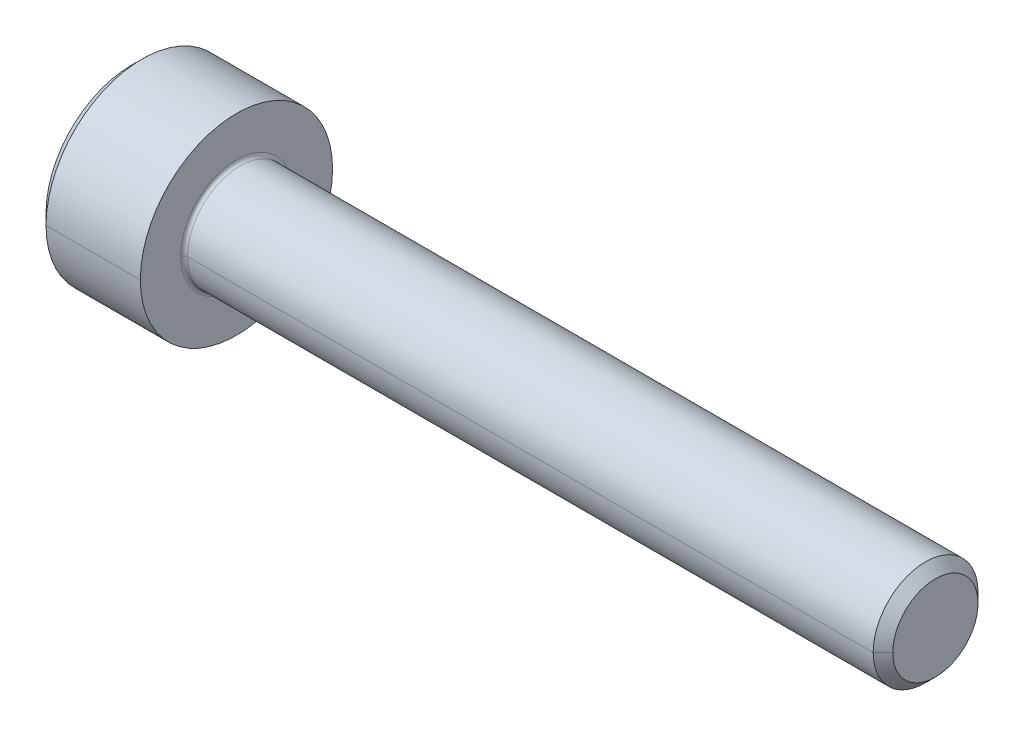
ISO-10303-21;
HEADER;
FILE_DESCRIPTION(('STEP AP214'),'2;1');
FILE_NAME('part.step','',(''),(''),'','','');
FILE_SCHEMA(('AUTOMOTIVE_DESIGN { 1 0 10303 214 1 1 1 1 }'));
ENDSEC;
DATA;
#1=APPLICATION_CONTEXT('core data for automotive mechanical design processes');
#2=APPLICATION_PROTOCOL_DEFINITION('international standard','automotive_design',2000,#1);
#3=PRODUCT_CONTEXT('',#1,'mechanical');
#4=PRODUCT('Part','Part','',(#3));
#5=PRODUCT_RELATED_PRODUCT_CATEGORY('part','',(#4));
#6=PRODUCT_DEFINITION_FORMATION('','',#4);
#7=PRODUCT_DEFINITION_CONTEXT('part definition',#1,'design');
#8=PRODUCT_DEFINITION('design','',#6,#7);
#9=PRODUCT_DEFINITION_SHAPE('','',#8);
#10=(LENGTH_UNIT() NAMED_UNIT(*) SI_UNIT(.MILLI.,.METRE.));
#11=(NAMED_UNIT(*) PLANE_ANGLE_UNIT() SI_UNIT($,.RADIAN.));
#12=(NAMED_UNIT(*) SI_UNIT($,.STERADIAN.) SOLID_ANGLE_UNIT());
#13=UNCERTAINTY_MEASURE_WITH_UNIT(LENGTH_MEASURE(1.E-05),#10,'distance_accuracy_value','');
#14=(GEOMETRIC_REPRESENTATION_CONTEXT(3) GLOBAL_UNCERTAINTY_ASSIGNED_CONTEXT((#13)) GLOBAL_UNIT_ASSIGNED_CONTEXT((#10,
#11,#12)) REPRESENTATION_CONTEXT('',''));
#15=CARTESIAN_POINT('',(0.,0.,0.));
#16=DIRECTION('',(0.,0.,1.));
#17=DIRECTION('',(1.,0.,0.));
#18=AXIS2_PLACEMENT_3D('',#15,#16,#17);
#19=CARTESIAN_POINT('',(1.3,0.,0.));
#20=DIRECTION('',(-1.,0.,0.));
#21=DIRECTION('',(0.,0.,1.));
#22=AXIS2_PLACEMENT_3D('',#19,#20,#21);
#23=CONICAL_SURFACE('',#22,1.28,1.0471975511966);
#24=DIRECTION('',(-0.5,0.,-0.866025403784438));
#25=VECTOR('',#24,1.);
#26=CARTESIAN_POINT('',(1.3,0.,-1.28));
#27=LINE('',#26,#25);
#28=CARTESIAN_POINT('',(2.03900834456273,0.,0.));
#29=VERTEX_POINT('',#28);
#30=CARTESIAN_POINT('',(1.3,0.,-1.28));
#31=VERTEX_POINT('',#30);
#32=EDGE_CURVE('E819',#29,#31,#27,.T.);
#33=ORIENTED_EDGE('',*,*,#32,.F.);
#34=DIRECTION('',(-0.5,0.,0.866025403784438));
#35=VECTOR('',#34,1.);
#36=CARTESIAN_POINT('',(1.3,0.,1.28));
#37=LINE('',#36,#35);
#38=CARTESIAN_POINT('',(1.3,0.,1.28));
#39=VERTEX_POINT('',#38);
#40=EDGE_CURVE('E821',#29,#39,#37,.T.);
#41=ORIENTED_EDGE('',*,*,#40,.T.);
#42=CARTESIAN_POINT('',(1.3,0.,0.));
#43=DIRECTION('',(-1.,0.,0.));
#44=DIRECTION('',(0.,0.,1.));
#45=AXIS2_PLACEMENT_3D('',#42,#43,#44);
#46=CIRCLE('',#45,1.28);
#47=CARTESIAN_POINT('',(1.3,1.10851251684408,0.64));
#48=VERTEX_POINT('',#47);
#49=EDGE_CURVE('E11',#39,#48,#46,.T.);
#50=ORIENTED_EDGE('',*,*,#49,.T.);
#51=CARTESIAN_POINT('',(1.3,0.,0.));
#52=DIRECTION('',(-1.,0.,0.));
#53=DIRECTION('',(0.,0.,1.));
#54=AXIS2_PLACEMENT_3D('',#51,#52,#53);
#55=CIRCLE('',#54,1.28);
#56=CARTESIAN_POINT('',(1.3,1.10851251684408,-0.64));
#57=VERTEX_POINT('',#56);
#58=EDGE_CURVE('E25',#48,#57,#55,.T.);
#59=ORIENTED_EDGE('',*,*,#58,.T.);
#60=CARTESIAN_POINT('',(1.3,0.,0.));
#61=DIRECTION('',(-1.,0.,0.));
#62=DIRECTION('',(0.,0.,1.));
#63=AXIS2_PLACEMENT_3D('',#60,#61,#62);
#64=CIRCLE('',#63,1.28);
#65=EDGE_CURVE('E247',#57,#31,#64,.T.);
#66=ORIENTED_EDGE('',*,*,#65,.T.);
#67=EDGE_LOOP('',(#33,#41,#50,#59,#66));
#68=FACE_BOUND('',#67,.T.);
#69=ADVANCED_FACE('F16',(#68),#23,.F.);
#70=CARTESIAN_POINT('',(1.3,0.73900834456272,1.28));
#71=DIRECTION('',(-1.,0.,0.));
#72=DIRECTION('',(0.,0.,1.));
#73=AXIS2_PLACEMENT_3D('',#70,#71,#72);
#74=PLANE('',#73);
#75=ORIENTED_EDGE('',*,*,#49,.F.);
#76=DIRECTION('',(0.,1.,0.));
#77=VECTOR('',#76,1.);
#78=CARTESIAN_POINT('',(1.3,-0.739008344562722,1.28));
#79=LINE('',#78,#77);
#80=CARTESIAN_POINT('',(1.3,0.73900834456272,1.28));
#81=VERTEX_POINT('',#80);
#82=EDGE_CURVE('E222',#39,#81,#79,.T.);
#83=ORIENTED_EDGE('',*,*,#82,.T.);
#84=DIRECTION('',(0.,-0.5,0.86602540378444));
#85=VECTOR('',#84,1.);
#86=CARTESIAN_POINT('',(1.3,1.47801668912544,0.));
#87=LINE('',#86,#85);
#88=EDGE_CURVE('E215',#48,#81,#87,.T.);
#89=ORIENTED_EDGE('',*,*,#88,.F.);
#90=EDGE_LOOP('',(#75,#83,#89));
#91=FACE_BOUND('',#90,.T.);
#92=ADVANCED_FACE('F520',(#91),#74,.T.);
#93=CARTESIAN_POINT('',(1.3,0.73900834456272,1.28));
#94=DIRECTION('',(-1.,0.,0.));
#95=DIRECTION('',(0.,0.,1.));
#96=AXIS2_PLACEMENT_3D('',#93,#94,#95);
#97=PLANE('',#96);
#98=ORIENTED_EDGE('',*,*,#58,.F.);
#99=DIRECTION('',(0.,-0.5,0.86602540378444));
#100=VECTOR('',#99,1.);
#101=CARTESIAN_POINT('',(1.3,1.47801668912544,0.));
#102=LINE('',#101,#100);
#103=CARTESIAN_POINT('',(1.3,1.47801668912544,0.));
#104=VERTEX_POINT('',#103);
#105=EDGE_CURVE('E214',#104,#48,#102,.T.);
#106=ORIENTED_EDGE('',*,*,#105,.F.);
#107=DIRECTION('',(0.,-0.5,-0.866025403784438));
#108=VECTOR('',#107,1.);
#109=CARTESIAN_POINT('',(1.3,1.47801668912544,0.));
#110=LINE('',#109,#108);
#111=EDGE_CURVE('E199',#104,#57,#110,.T.);
#112=ORIENTED_EDGE('',*,*,#111,.T.);
#113=EDGE_LOOP('',(#98,#106,#112));
#114=FACE_BOUND('',#113,.T.);
#115=ADVANCED_FACE('F511',(#114),#97,.T.);
#116=CARTESIAN_POINT('',(1.3,0.73900834456272,1.28));
#117=DIRECTION('',(-1.,0.,0.));
#118=DIRECTION('',(0.,0.,1.));
#119=AXIS2_PLACEMENT_3D('',#116,#117,#118);
#120=PLANE('',#119);
#121=ORIENTED_EDGE('',*,*,#65,.F.);
#122=DIRECTION('',(0.,-0.5,-0.866025403784438));
#123=VECTOR('',#122,1.);
#124=CARTESIAN_POINT('',(1.3,1.47801668912544,0.));
#125=LINE('',#124,#123);
#126=CARTESIAN_POINT('',(1.3,0.739008344562716,-1.28));
#127=VERTEX_POINT('',#126);
#128=EDGE_CURVE('E196',#57,#127,#125,.T.);
#129=ORIENTED_EDGE('',*,*,#128,.T.);
#130=DIRECTION('',(0.,-1.,0.));
#131=VECTOR('',#130,1.);
#132=CARTESIAN_POINT('',(1.3,0.739008344562716,-1.28));
#133=LINE('',#132,#131);
#134=EDGE_CURVE('E136',#127,#31,#133,.T.);
#135=ORIENTED_EDGE('',*,*,#134,.T.);
#136=EDGE_LOOP('',(#121,#129,#135));
#137=FACE_BOUND('',#136,.T.);
#138=ADVANCED_FACE('F503',(#137),#120,.T.);
#139=CARTESIAN_POINT('',(1.3,0.73900834456272,1.28));
#140=DIRECTION('',(-1.,0.,0.));
#141=DIRECTION('',(0.,0.,1.));
#142=AXIS2_PLACEMENT_3D('',#139,#140,#141);
#143=PLANE('',#142);
#144=CARTESIAN_POINT('',(1.3,0.,0.));
#145=DIRECTION('',(-1.,0.,0.));
#146=DIRECTION('',(0.,0.,1.));
#147=AXIS2_PLACEMENT_3D('',#144,#145,#146);
#148=CIRCLE('',#147,1.28);
#149=CARTESIAN_POINT('',(1.3,-1.10851251684409,-0.64));
#150=VERTEX_POINT('',#149);
#151=EDGE_CURVE('E131',#31,#150,#148,.T.);
#152=ORIENTED_EDGE('',*,*,#151,.F.);
#153=DIRECTION('',(0.,-1.,0.));
#154=VECTOR('',#153,1.);
#155=CARTESIAN_POINT('',(1.3,0.739008344562716,-1.28));
#156=LINE('',#155,#154);
#157=CARTESIAN_POINT('',(1.3,-0.739008344562726,-1.28));
#158=VERTEX_POINT('',#157);
#159=EDGE_CURVE('E122',#31,#158,#156,.T.);
#160=ORIENTED_EDGE('',*,*,#159,.T.);
#161=DIRECTION('',(0.,0.5,-0.86602540378444));
#162=VECTOR('',#161,1.);
#163=CARTESIAN_POINT('',(1.3,-1.47801668912544,0.));
#164=LINE('',#163,#162);
#165=EDGE_CURVE('E127',#150,#158,#164,.T.);
#166=ORIENTED_EDGE('',*,*,#165,.F.);
#167=EDGE_LOOP('',(#152,#160,#166));
#168=FACE_BOUND('',#167,.T.);
#169=ADVANCED_FACE('F124',(#168),#143,.T.);
#170=CARTESIAN_POINT('',(1.3,0.73900834456272,1.28));
#171=DIRECTION('',(-1.,0.,0.));
#172=DIRECTION('',(0.,0.,1.));
#173=AXIS2_PLACEMENT_3D('',#170,#171,#172);
#174=PLANE('',#173);
#175=CARTESIAN_POINT('',(1.3,0.,0.));
#176=DIRECTION('',(-1.,0.,0.));
#177=DIRECTION('',(0.,0.,1.));
#178=AXIS2_PLACEMENT_3D('',#175,#176,#177);
#179=CIRCLE('',#178,1.28);
#180=CARTESIAN_POINT('',(1.3,-1.10851251684408,0.64));
#181=VERTEX_POINT('',#180);
#182=EDGE_CURVE('E834',#150,#181,#179,.T.);
#183=ORIENTED_EDGE('',*,*,#182,.F.);
#184=DIRECTION('',(0.,0.5,-0.86602540378444));
#185=VECTOR('',#184,1.);
#186=CARTESIAN_POINT('',(1.3,-1.47801668912544,0.));
#187=LINE('',#186,#185);
#188=CARTESIAN_POINT('',(1.3,-1.47801668912544,0.));
#189=VERTEX_POINT('',#188);
#190=EDGE_CURVE('E150',#189,#150,#187,.T.);
#191=ORIENTED_EDGE('',*,*,#190,.F.);
#192=DIRECTION('',(0.,-0.5,-0.866025403784438));
#193=VECTOR('',#192,1.);
#194=CARTESIAN_POINT('',(1.3,-0.739008344562722,1.28));
#195=LINE('',#194,#193);
#196=EDGE_CURVE('E236',#181,#189,#195,.T.);
#197=ORIENTED_EDGE('',*,*,#196,.F.);
#198=EDGE_LOOP('',(#183,#191,#197));
#199=FACE_BOUND('',#198,.T.);
#200=ADVANCED_FACE('F486',(#199),#174,.T.);
#201=CARTESIAN_POINT('',(1.3,0.73900834456272,1.28));
#202=DIRECTION('',(-1.,0.,0.));
#203=DIRECTION('',(0.,0.,1.));
#204=AXIS2_PLACEMENT_3D('',#201,#202,#203);
#205=PLANE('',#204);
#206=CARTESIAN_POINT('',(1.3,0.,0.));
#207=DIRECTION('',(-1.,0.,0.));
#208=DIRECTION('',(0.,0.,1.));
#209=AXIS2_PLACEMENT_3D('',#206,#207,#208);
#210=CIRCLE('',#209,1.28);
#211=EDGE_CURVE('E826',#181,#39,#210,.T.);
#212=ORIENTED_EDGE('',*,*,#211,.F.);
#213=DIRECTION('',(0.,-0.5,-0.866025403784438));
#214=VECTOR('',#213,1.);
#215=CARTESIAN_POINT('',(1.3,-0.739008344562722,1.28));
#216=LINE('',#215,#214);
#217=CARTESIAN_POINT('',(1.3,-0.739008344562722,1.28));
#218=VERTEX_POINT('',#217);
#219=EDGE_CURVE('E232',#218,#181,#216,.T.);
#220=ORIENTED_EDGE('',*,*,#219,.F.);
#221=DIRECTION('',(0.,1.,0.));
#222=VECTOR('',#221,1.);
#223=CARTESIAN_POINT('',(1.3,-0.739008344562722,1.28));
#224=LINE('',#223,#222);
#225=EDGE_CURVE('E225',#218,#39,#224,.T.);
#226=ORIENTED_EDGE('',*,*,#225,.T.);
#227=EDGE_LOOP('',(#212,#220,#226));
#228=FACE_BOUND('',#227,.T.);
#229=ADVANCED_FACE('F477',(#228),#205,.T.);
#230=CARTESIAN_POINT('',(1.3,1.47801668912544,0.));
#231=DIRECTION('',(0.,0.866025403784438,-0.5));
#232=DIRECTION('',(-1.,0.,0.));
#233=AXIS2_PLACEMENT_3D('',#230,#231,#232);
#234=PLANE('',#233);
#235=DIRECTION('',(0.,-0.5,-0.866025403784438));
#236=VECTOR('',#235,1.);
#237=CARTESIAN_POINT('',(0.,1.47801668912544,0.));
#238=LINE('',#237,#236);
#239=CARTESIAN_POINT('',(0.,1.47801668912544,0.));
#240=VERTEX_POINT('',#239);
#241=CARTESIAN_POINT('',(0.,0.739008344562716,-1.28));
#242=VERTEX_POINT('',#241);
#243=EDGE_CURVE('E185',#240,#242,#238,.T.);
#244=ORIENTED_EDGE('',*,*,#243,.T.);
#245=DIRECTION('',(-1.,0.,0.));
#246=VECTOR('',#245,1.);
#247=CARTESIAN_POINT('',(1.3,0.739008344562716,-1.28));
#248=LINE('',#247,#246);
#249=EDGE_CURVE('E200',#127,#242,#248,.T.);
#250=ORIENTED_EDGE('',*,*,#249,.F.);
#251=ORIENTED_EDGE('',*,*,#128,.F.);
#252=ORIENTED_EDGE('',*,*,#111,.F.);
#253=DIRECTION('',(-1.,0.,0.));
#254=VECTOR('',#253,1.);
#255=CARTESIAN_POINT('',(1.3,1.47801668912544,0.));
#256=LINE('',#255,#254);
#257=EDGE_CURVE('E211',#104,#240,#256,.T.);
#258=ORIENTED_EDGE('',*,*,#257,.T.);
#259=EDGE_LOOP('',(#244,#250,#251,#252,#258));
#260=FACE_BOUND('',#259,.T.);
#261=ADVANCED_FACE('F469',(#260),#234,.F.);
#262=CARTESIAN_POINT('',(1.3,0.739008344562716,-1.28));
#263=DIRECTION('',(0.,0.,-1.));
#264=DIRECTION('',(0.,-1.,0.));
#265=AXIS2_PLACEMENT_3D('',#262,#263,#264);
#266=PLANE('',#265);
#267=DIRECTION('',(0.,-1.,0.));
#268=VECTOR('',#267,1.);
#269=CARTESIAN_POINT('',(0.,0.739008344562716,-1.28));
#270=LINE('',#269,#268);
#271=CARTESIAN_POINT('',(0.,-0.739008344562726,-1.28));
#272=VERTEX_POINT('',#271);
#273=EDGE_CURVE('E142',#242,#272,#270,.T.);
#274=ORIENTED_EDGE('',*,*,#273,.T.);
#275=DIRECTION('',(-1.,0.,0.));
#276=VECTOR('',#275,1.);
#277=CARTESIAN_POINT('',(1.3,-0.739008344562726,-1.28));
#278=LINE('',#277,#276);
#279=EDGE_CURVE('E137',#158,#272,#278,.T.);
#280=ORIENTED_EDGE('',*,*,#279,.F.);
#281=ORIENTED_EDGE('',*,*,#159,.F.);
#282=ORIENTED_EDGE('',*,*,#134,.F.);
#283=ORIENTED_EDGE('',*,*,#249,.T.);
#284=EDGE_LOOP('',(#274,#280,#281,#282,#283));
#285=FACE_BOUND('',#284,.T.);
#286=ADVANCED_FACE('F140',(#285),#266,.F.);
#287=CARTESIAN_POINT('',(1.3,-1.47801668912544,0.));
#288=DIRECTION('',(0.,0.86602540378444,0.5));
#289=DIRECTION('',(1.,0.,0.));
#290=AXIS2_PLACEMENT_3D('',#287,#288,#289);
#291=PLANE('',#290);
#292=DIRECTION('',(0.,0.5,-0.86602540378444));
#293=VECTOR('',#292,1.);
#294=CARTESIAN_POINT('',(0.,-1.47801668912544,0.));
#295=LINE('',#294,#293);
#296=CARTESIAN_POINT('',(0.,-1.47801668912544,0.));
#297=VERTEX_POINT('',#296);
#298=EDGE_CURVE('E179',#297,#272,#295,.T.);
#299=ORIENTED_EDGE('',*,*,#298,.F.);
#300=DIRECTION('',(-1.,0.,0.));
#301=VECTOR('',#300,1.);
#302=CARTESIAN_POINT('',(1.3,-1.47801668912544,0.));
#303=LINE('',#302,#301);
#304=EDGE_CURVE('E158',#189,#297,#303,.T.);
#305=ORIENTED_EDGE('',*,*,#304,.F.);
#306=ORIENTED_EDGE('',*,*,#190,.T.);
#307=ORIENTED_EDGE('',*,*,#165,.T.);
#308=ORIENTED_EDGE('',*,*,#279,.T.);
#309=EDGE_LOOP('',(#299,#305,#306,#307,#308));
#310=FACE_BOUND('',#309,.T.);
#311=ADVANCED_FACE('F148',(#310),#291,.T.);
#312=CARTESIAN_POINT('',(1.3,-0.739008344562722,1.28));
#313=DIRECTION('',(0.,0.866025403784438,-0.5));
#314=DIRECTION('',(-1.,0.,0.));
#315=AXIS2_PLACEMENT_3D('',#312,#313,#314);
#316=PLANE('',#315);
#317=DIRECTION('',(0.,-0.5,-0.866025403784438));
#318=VECTOR('',#317,1.);
#319=CARTESIAN_POINT('',(0.,-0.739008344562722,1.28));
#320=LINE('',#319,#318);
#321=CARTESIAN_POINT('',(0.,-0.739008344562722,1.28));
#322=VERTEX_POINT('',#321);
#323=EDGE_CURVE('E175',#322,#297,#320,.T.);
#324=ORIENTED_EDGE('',*,*,#323,.F.);
#325=DIRECTION('',(-1.,0.,0.));
#326=VECTOR('',#325,1.);
#327=CARTESIAN_POINT('',(1.3,-0.739008344562722,1.28));
#328=LINE('',#327,#326);
#329=EDGE_CURVE('E229',#218,#322,#328,.T.);
#330=ORIENTED_EDGE('',*,*,#329,.F.);
#331=ORIENTED_EDGE('',*,*,#219,.T.);
#332=ORIENTED_EDGE('',*,*,#196,.T.);
#333=ORIENTED_EDGE('',*,*,#304,.T.);
#334=EDGE_LOOP('',(#324,#330,#331,#332,#333));
#335=FACE_BOUND('',#334,.T.);
#336=ADVANCED_FACE('F346',(#335),#316,.T.);
#337=CARTESIAN_POINT('',(1.3,-0.739008344562722,1.28));
#338=DIRECTION('',(0.,0.,1.));
#339=DIRECTION('',(0.,-1.,0.));
#340=AXIS2_PLACEMENT_3D('',#337,#338,#339);
#341=PLANE('',#340);
#342=DIRECTION('',(0.,1.,0.));
#343=VECTOR('',#342,1.);
#344=CARTESIAN_POINT('',(0.,-0.739008344562722,1.28));
#345=LINE('',#344,#343);
#346=CARTESIAN_POINT('',(0.,0.73900834456272,1.28));
#347=VERTEX_POINT('',#346);
#348=EDGE_CURVE('E171',#322,#347,#345,.T.);
#349=ORIENTED_EDGE('',*,*,#348,.T.);
#350=DIRECTION('',(-1.,0.,0.));
#351=VECTOR('',#350,1.);
#352=CARTESIAN_POINT('',(1.3,0.73900834456272,1.28));
#353=LINE('',#352,#351);
#354=EDGE_CURVE('E219',#81,#347,#353,.T.);
#355=ORIENTED_EDGE('',*,*,#354,.F.);
#356=ORIENTED_EDGE('',*,*,#82,.F.);
#357=ORIENTED_EDGE('',*,*,#225,.F.);
#358=ORIENTED_EDGE('',*,*,#329,.T.);
#359=EDGE_LOOP('',(#349,#355,#356,#357,#358));
#360=FACE_BOUND('',#359,.T.);
#361=ADVANCED_FACE('F350',(#360),#341,.F.);
#362=CARTESIAN_POINT('',(1.3,1.47801668912544,0.));
#363=DIRECTION('',(0.,-0.86602540378444,-0.5));
#364=DIRECTION('',(0.,0.5,-0.86602540378444));
#365=AXIS2_PLACEMENT_3D('',#362,#363,#364);
#366=PLANE('',#365);
#367=DIRECTION('',(0.,-0.5,0.86602540378444));
#368=VECTOR('',#367,1.);
#369=CARTESIAN_POINT('',(0.,1.47801668912544,0.));
#370=LINE('',#369,#368);
#371=EDGE_CURVE('E167',#240,#347,#370,.T.);
#372=ORIENTED_EDGE('',*,*,#371,.F.);
#373=ORIENTED_EDGE('',*,*,#257,.F.);
#374=ORIENTED_EDGE('',*,*,#105,.T.);
#375=ORIENTED_EDGE('',*,*,#88,.T.);
#376=ORIENTED_EDGE('',*,*,#354,.T.);
#377=EDGE_LOOP('',(#372,#373,#374,#375,#376));
#378=FACE_BOUND('',#377,.T.);
#379=ADVANCED_FACE('F409',(#378),#366,.T.);
#380=CARTESIAN_POINT('',(3.1,0.,0.));
#381=DIRECTION('',(1.,0.,0.));
#382=DIRECTION('',(0.,0.,-1.));
#383=AXIS2_PLACEMENT_3D('',#380,#381,#382);
#384=TOROIDAL_SURFACE('',#383,1.59999999999997,0.1);
#385=CARTESIAN_POINT('',(3.1,0.,1.59999999999997));
#386=DIRECTION('',(0.,1.,0.));
#387=DIRECTION('',(0.,0.,1.));
#388=AXIS2_PLACEMENT_3D('',#385,#386,#387);
#389=CIRCLE('',#388,0.1);
#390=CARTESIAN_POINT('',(3.1,0.,1.49999999999997));
#391=VERTEX_POINT('',#390);
#392=CARTESIAN_POINT('',(3.,0.,1.59999999999997));
#393=VERTEX_POINT('',#392);
#394=EDGE_CURVE('E794',#391,#393,#389,.T.);
#395=ORIENTED_EDGE('',*,*,#394,.F.);
#396=CARTESIAN_POINT('',(3.1,0.,0.));
#397=DIRECTION('',(1.,0.,0.));
#398=DIRECTION('',(0.,0.,-1.));
#399=AXIS2_PLACEMENT_3D('',#396,#397,#398);
#400=CIRCLE('',#399,1.49999999999997);
#401=CARTESIAN_POINT('',(3.1,0.,-1.49999999999997));
#402=VERTEX_POINT('',#401);
#403=EDGE_CURVE('E754',#402,#391,#400,.T.);
#404=ORIENTED_EDGE('',*,*,#403,.F.);
#405=CARTESIAN_POINT('',(3.1,0.,-1.59999999999997));
#406=DIRECTION('',(0.,-1.,0.));
#407=DIRECTION('',(0.,0.,-1.));
#408=AXIS2_PLACEMENT_3D('',#405,#406,#407);
#409=CIRCLE('',#408,0.1);
#410=CARTESIAN_POINT('',(3.,0.,-1.59999999999997));
#411=VERTEX_POINT('',#410);
#412=EDGE_CURVE('E743',#402,#411,#409,.T.);
#413=ORIENTED_EDGE('',*,*,#412,.T.);
#414=CARTESIAN_POINT('',(3.,0.,0.));
#415=DIRECTION('',(-1.,0.,0.));
#416=DIRECTION('',(0.,0.,-1.));
#417=AXIS2_PLACEMENT_3D('',#414,#415,#416);
#418=CIRCLE('',#417,1.59999999999997);
#419=EDGE_CURVE('E204',#393,#411,#418,.T.);
#420=ORIENTED_EDGE('',*,*,#419,.F.);
#421=EDGE_LOOP('',(#395,#404,#413,#420));
#422=FACE_BOUND('',#421,.T.);
#423=ADVANCED_FACE('F340',(#422),#384,.F.);
#424=CARTESIAN_POINT('',(0.,0.,0.));
#425=DIRECTION('',(1.,0.,0.));
#426=DIRECTION('',(0.,0.,-1.));
#427=AXIS2_PLACEMENT_3D('',#424,#425,#426);
#428=CONICAL_SURFACE('',#427,2.45,0.78539816339744);
#429=DIRECTION('',(0.707106781186554,0.,0.707106781186542));
#430=VECTOR('',#429,1.);
#431=CARTESIAN_POINT('',(0.,0.,2.45));
#432=LINE('',#431,#430);
#433=CARTESIAN_POINT('',(0.,0.,2.45));
#434=VERTEX_POINT('',#433);
#435=CARTESIAN_POINT('',(0.3,0.,2.75));
#436=VERTEX_POINT('',#435);
#437=EDGE_CURVE('E733',#434,#436,#432,.T.);
#438=ORIENTED_EDGE('',*,*,#437,.F.);
#439=CARTESIAN_POINT('',(0.,0.,0.));
#440=DIRECTION('',(-1.,0.,0.));
#441=DIRECTION('',(0.,0.,1.));
#442=AXIS2_PLACEMENT_3D('',#439,#440,#441);
#443=CIRCLE('',#442,2.45);
#444=CARTESIAN_POINT('',(0.,0.,-2.45));
#445=VERTEX_POINT('',#444);
#446=EDGE_CURVE('E164',#445,#434,#443,.T.);
#447=ORIENTED_EDGE('',*,*,#446,.F.);
#448=DIRECTION('',(0.707106781186554,0.,-0.707106781186542));
#449=VECTOR('',#448,1.);
#450=CARTESIAN_POINT('',(0.,0.,-2.45));
#451=LINE('',#450,#449);
#452=CARTESIAN_POINT('',(0.3,0.,-2.75));
#453=VERTEX_POINT('',#452);
#454=EDGE_CURVE('E728',#445,#453,#451,.T.);
#455=ORIENTED_EDGE('',*,*,#454,.T.);
#456=CARTESIAN_POINT('',(0.3,0.,0.));
#457=DIRECTION('',(-1.,0.,0.));
#458=DIRECTION('',(0.,0.,1.));
#459=AXIS2_PLACEMENT_3D('',#456,#457,#458);
#460=CIRCLE('',#459,2.75);
#461=EDGE_CURVE('E208',#453,#436,#460,.T.);
#462=ORIENTED_EDGE('',*,*,#461,.T.);
#463=EDGE_LOOP('',(#438,#447,#455,#462));
#464=FACE_BOUND('',#463,.T.);
#465=ADVANCED_FACE('F336',(#464),#428,.T.);
#466=CARTESIAN_POINT('',(-31.75,0.,0.));
#467=DIRECTION('',(-1.,0.,0.));
#468=DIRECTION('',(0.,0.,1.));
#469=AXIS2_PLACEMENT_3D('',#466,#467,#468);
#470=CYLINDRICAL_SURFACE('',#469,2.75);
#471=DIRECTION('',(-1.,0.,0.));
#472=VECTOR('',#471,1.);
#473=CARTESIAN_POINT('',(-31.75,0.,-2.75));
#474=LINE('',#473,#472);
#475=CARTESIAN_POINT('',(3.,0.,-2.75));
#476=VERTEX_POINT('',#475);
#477=EDGE_CURVE('E713',#476,#453,#474,.T.);
#478=ORIENTED_EDGE('',*,*,#477,.F.);
#479=CARTESIAN_POINT('',(3.,0.,0.));
#480=DIRECTION('',(-1.,0.,0.));
#481=DIRECTION('',(0.,0.,1.));
#482=AXIS2_PLACEMENT_3D('',#479,#480,#481);
#483=CIRCLE('',#482,2.75);
#484=CARTESIAN_POINT('',(3.,0.,2.75));
#485=VERTEX_POINT('',#484);
#486=EDGE_CURVE('E195',#476,#485,#483,.T.);
#487=ORIENTED_EDGE('',*,*,#486,.T.);
#488=DIRECTION('',(-1.,0.,0.));
#489=VECTOR('',#488,1.);
#490=CARTESIAN_POINT('',(-31.75,0.,2.75));
#491=LINE('',#490,#489);
#492=EDGE_CURVE('E716',#485,#436,#491,.T.);
#493=ORIENTED_EDGE('',*,*,#492,.T.);
#494=ORIENTED_EDGE('',*,*,#461,.F.);
#495=EDGE_LOOP('',(#478,#487,#493,#494));
#496=FACE_BOUND('',#495,.T.);
#497=ADVANCED_FACE('F321',(#496),#470,.T.);
#498=CARTESIAN_POINT('',(3.,2.75,0.));
#499=DIRECTION('',(1.,0.,0.));
#500=DIRECTION('',(0.,1.,0.));
#501=AXIS2_PLACEMENT_3D('',#498,#499,#500);
#502=PLANE('',#501);
#503=CARTESIAN_POINT('',(3.,0.,0.));
#504=DIRECTION('',(-1.,0.,0.));
#505=DIRECTION('',(0.,0.,-1.));
#506=AXIS2_PLACEMENT_3D('',#503,#504,#505);
#507=CIRCLE('',#506,1.59999999999997);
#508=EDGE_CURVE('E797',#411,#393,#507,.T.);
#509=ORIENTED_EDGE('',*,*,#508,.T.);
#510=ORIENTED_EDGE('',*,*,#419,.T.);
#511=EDGE_LOOP('',(#509,#510));
#512=FACE_BOUND('',#511,.T.);
#513=CARTESIAN_POINT('',(3.,0.,0.));
#514=DIRECTION('',(-1.,0.,0.));
#515=DIRECTION('',(0.,0.,1.));
#516=AXIS2_PLACEMENT_3D('',#513,#514,#515);
#517=CIRCLE('',#516,2.75);
#518=EDGE_CURVE('E724',#485,#476,#517,.T.);
#519=ORIENTED_EDGE('',*,*,#518,.F.);
#520=ORIENTED_EDGE('',*,*,#486,.F.);
#521=EDGE_LOOP('',(#519,#520));
#522=FACE_BOUND('',#521,.T.);
#523=ADVANCED_FACE('F316',(#512,#522),#502,.T.);
#524=CARTESIAN_POINT('',(-31.75,0.,0.));
#525=DIRECTION('',(-1.,0.,0.));
#526=DIRECTION('',(0.,0.,1.));
#527=AXIS2_PLACEMENT_3D('',#524,#525,#526);
#528=CYLINDRICAL_SURFACE('',#527,1.49999999999997);
#529=DIRECTION('',(-1.,0.,0.));
#530=VECTOR('',#529,1.);
#531=CARTESIAN_POINT('',(-31.75,0.,-1.49999999999997));
#532=LINE('',#531,#530);
#533=CARTESIAN_POINT('',(22.7195,0.,-1.49999999999993));
#534=VERTEX_POINT('',#533);
#535=EDGE_CURVE('E753',#534,#402,#532,.T.);
#536=ORIENTED_EDGE('',*,*,#535,.F.);
#537=CARTESIAN_POINT('',(22.7195,0.,0.));
#538=DIRECTION('',(-1.,0.,0.));
#539=DIRECTION('',(0.,0.,1.));
#540=AXIS2_PLACEMENT_3D('',#537,#538,#539);
#541=CIRCLE('',#540,1.49999999999993);
#542=CARTESIAN_POINT('',(22.7195,0.,1.49999999999993));
#543=VERTEX_POINT('',#542);
#544=EDGE_CURVE('E184',#534,#543,#541,.T.);
#545=ORIENTED_EDGE('',*,*,#544,.T.);
#546=DIRECTION('',(-1.,0.,0.));
#547=VECTOR('',#546,1.);
#548=CARTESIAN_POINT('',(-31.75,0.,1.49999999999997));
#549=LINE('',#548,#547);
#550=EDGE_CURVE('E758',#543,#391,#549,.T.);
#551=ORIENTED_EDGE('',*,*,#550,.T.);
#552=CARTESIAN_POINT('',(3.1,0.,0.));
#553=DIRECTION('',(1.,0.,0.));
#554=DIRECTION('',(0.,0.,-1.));
#555=AXIS2_PLACEMENT_3D('',#552,#553,#554);
#556=CIRCLE('',#555,1.49999999999997);
#557=EDGE_CURVE('E783',#391,#402,#556,.T.);
#558=ORIENTED_EDGE('',*,*,#557,.T.);
#559=EDGE_LOOP('',(#536,#545,#551,#558));
#560=FACE_BOUND('',#559,.T.);
#561=ADVANCED_FACE('F320',(#560),#528,.T.);
#562=CARTESIAN_POINT('',(23.,0.,0.));
#563=DIRECTION('',(-1.,0.,0.));
#564=DIRECTION('',(0.,0.,1.));
#565=AXIS2_PLACEMENT_3D('',#562,#563,#564);
#566=CONICAL_SURFACE('',#565,1.2195,0.785398163397236);
#567=DIRECTION('',(-0.707106781186698,0.,-0.707106781186398));
#568=VECTOR('',#567,1.);
#569=CARTESIAN_POINT('',(23.,0.,-1.2195));
#570=LINE('',#569,#568);
#571=CARTESIAN_POINT('',(23.,0.,-1.2195));
#572=VERTEX_POINT('',#571);
#573=EDGE_CURVE('E764',#572,#534,#570,.T.);
#574=ORIENTED_EDGE('',*,*,#573,.F.);
#575=CARTESIAN_POINT('',(23.,0.,0.));
#576=DIRECTION('',(-1.,0.,0.));
#577=DIRECTION('',(0.,0.,1.));
#578=AXIS2_PLACEMENT_3D('',#575,#576,#577);
#579=CIRCLE('',#578,1.2195);
#580=CARTESIAN_POINT('',(23.,0.,1.2195));
#581=VERTEX_POINT('',#580);
#582=EDGE_CURVE('E180',#572,#581,#579,.T.);
#583=ORIENTED_EDGE('',*,*,#582,.T.);
#584=DIRECTION('',(-0.707106781186698,0.,0.707106781186398));
#585=VECTOR('',#584,1.);
#586=CARTESIAN_POINT('',(23.,0.,1.2195));
#587=LINE('',#586,#585);
#588=EDGE_CURVE('E162',#581,#543,#587,.T.);
#589=ORIENTED_EDGE('',*,*,#588,.T.);
#590=ORIENTED_EDGE('',*,*,#544,.F.);
#591=EDGE_LOOP('',(#574,#583,#589,#590));
#592=FACE_BOUND('',#591,.T.);
#593=ADVANCED_FACE('F418',(#592),#566,.T.);
#594=CARTESIAN_POINT('',(23.,1.2195,0.));
#595=DIRECTION('',(1.,0.,0.));
#596=DIRECTION('',(0.,1.,0.));
#597=AXIS2_PLACEMENT_3D('',#594,#595,#596);
#598=PLANE('',#597);
#599=CARTESIAN_POINT('',(23.,0.,0.));
#600=DIRECTION('',(-1.,0.,0.));
#601=DIRECTION('',(0.,0.,1.));
#602=AXIS2_PLACEMENT_3D('',#599,#600,#601);
#603=CIRCLE('',#602,1.2195);
#604=EDGE_CURVE('E761',#581,#572,#603,.T.);
#605=ORIENTED_EDGE('',*,*,#604,.F.);
#606=ORIENTED_EDGE('',*,*,#582,.F.);
#607=EDGE_LOOP('',(#605,#606));
#608=FACE_BOUND('',#607,.T.);
#609=ADVANCED_FACE('F403',(#608),#598,.T.);
#610=CARTESIAN_POINT('',(0.,0.,0.));
#611=DIRECTION('',(-1.,0.,0.));
#612=DIRECTION('',(0.,0.,1.));
#613=AXIS2_PLACEMENT_3D('',#610,#611,#612);
#614=PLANE('',#613);
#615=ORIENTED_EDGE('',*,*,#371,.T.);
#616=ORIENTED_EDGE('',*,*,#348,.F.);
#617=ORIENTED_EDGE('',*,*,#323,.T.);
#618=ORIENTED_EDGE('',*,*,#298,.T.);
#619=ORIENTED_EDGE('',*,*,#273,.F.);
#620=ORIENTED_EDGE('',*,*,#243,.F.);
#621=EDGE_LOOP('',(#615,#616,#617,#618,#619,#620));
#622=FACE_BOUND('',#621,.T.);
#623=ORIENTED_EDGE('',*,*,#446,.T.);
#624=CARTESIAN_POINT('',(0.,0.,0.));
#625=DIRECTION('',(-1.,0.,0.));
#626=DIRECTION('',(0.,0.,1.));
#627=AXIS2_PLACEMENT_3D('',#624,#625,#626);
#628=CIRCLE('',#627,2.45);
#629=EDGE_CURVE('E739',#434,#445,#628,.T.);
#630=ORIENTED_EDGE('',*,*,#629,.T.);
#631=EDGE_LOOP('',(#623,#630));
#632=FACE_BOUND('',#631,.T.);
#633=ADVANCED_FACE('F394',(#622,#632),#614,.T.);
#634=CARTESIAN_POINT('',(23.,0.,0.));
#635=DIRECTION('',(-1.,0.,0.));
#636=DIRECTION('',(0.,0.,1.));
#637=AXIS2_PLACEMENT_3D('',#634,#635,#636);
#638=CONICAL_SURFACE('',#637,1.2195,0.785398163397236);
#639=ORIENTED_EDGE('',*,*,#604,.T.);
#640=ORIENTED_EDGE('',*,*,#573,.T.);
#641=CARTESIAN_POINT('',(22.7195,0.,0.));
#642=DIRECTION('',(-1.,0.,0.));
#643=DIRECTION('',(0.,0.,1.));
#644=AXIS2_PLACEMENT_3D('',#641,#642,#643);
#645=CIRCLE('',#644,1.49999999999993);
#646=EDGE_CURVE('E749',#543,#534,#645,.T.);
#647=ORIENTED_EDGE('',*,*,#646,.F.);
#648=ORIENTED_EDGE('',*,*,#588,.F.);
#649=EDGE_LOOP('',(#639,#640,#647,#648));
#650=FACE_BOUND('',#649,.T.);
#651=ADVANCED_FACE('F385',(#650),#638,.T.);
#652=CARTESIAN_POINT('',(-31.75,0.,0.));
#653=DIRECTION('',(-1.,0.,0.));
#654=DIRECTION('',(0.,0.,1.));
#655=AXIS2_PLACEMENT_3D('',#652,#653,#654);
#656=CYLINDRICAL_SURFACE('',#655,1.49999999999997);
#657=ORIENTED_EDGE('',*,*,#646,.T.);
#658=ORIENTED_EDGE('',*,*,#535,.T.);
#659=ORIENTED_EDGE('',*,*,#403,.T.);
#660=ORIENTED_EDGE('',*,*,#550,.F.);
#661=EDGE_LOOP('',(#657,#658,#659,#660));
#662=FACE_BOUND('',#661,.T.);
#663=ADVANCED_FACE('F376',(#662),#656,.T.);
#664=CARTESIAN_POINT('',(-31.75,0.,0.));
#665=DIRECTION('',(-1.,0.,0.));
#666=DIRECTION('',(0.,0.,1.));
#667=AXIS2_PLACEMENT_3D('',#664,#665,#666);
#668=CYLINDRICAL_SURFACE('',#667,2.75);
#669=ORIENTED_EDGE('',*,*,#518,.T.);
#670=ORIENTED_EDGE('',*,*,#477,.T.);
#671=CARTESIAN_POINT('',(0.3,0.,0.));
#672=DIRECTION('',(-1.,0.,0.));
#673=DIRECTION('',(0.,0.,1.));
#674=AXIS2_PLACEMENT_3D('',#671,#672,#673);
#675=CIRCLE('',#674,2.75);
#676=EDGE_CURVE('E721',#436,#453,#675,.T.);
#677=ORIENTED_EDGE('',*,*,#676,.F.);
#678=ORIENTED_EDGE('',*,*,#492,.F.);
#679=EDGE_LOOP('',(#669,#670,#677,#678));
#680=FACE_BOUND('',#679,.T.);
#681=ADVANCED_FACE('F359',(#680),#668,.T.);
#682=CARTESIAN_POINT('',(0.,0.,0.));
#683=DIRECTION('',(1.,0.,0.));
#684=DIRECTION('',(0.,0.,-1.));
#685=AXIS2_PLACEMENT_3D('',#682,#683,#684);
#686=CONICAL_SURFACE('',#685,2.45,0.78539816339744);
#687=ORIENTED_EDGE('',*,*,#629,.F.);
#688=ORIENTED_EDGE('',*,*,#437,.T.);
#689=ORIENTED_EDGE('',*,*,#676,.T.);
#690=ORIENTED_EDGE('',*,*,#454,.F.);
#691=EDGE_LOOP('',(#687,#688,#689,#690));
#692=FACE_BOUND('',#691,.T.);
#693=ADVANCED_FACE('F330',(#692),#686,.T.);
#694=CARTESIAN_POINT('',(3.1,0.,0.));
#695=DIRECTION('',(1.,0.,0.));
#696=DIRECTION('',(0.,0.,-1.));
#697=AXIS2_PLACEMENT_3D('',#694,#695,#696);
#698=TOROIDAL_SURFACE('',#697,1.59999999999997,0.1);
#699=ORIENTED_EDGE('',*,*,#557,.F.);
#700=ORIENTED_EDGE('',*,*,#394,.T.);
#701=ORIENTED_EDGE('',*,*,#508,.F.);
#702=ORIENTED_EDGE('',*,*,#412,.F.);
#703=EDGE_LOOP('',(#699,#700,#701,#702));
#704=FACE_BOUND('',#703,.T.);
#705=ADVANCED_FACE('F311',(#704),#698,.F.);
#706=CARTESIAN_POINT('',(1.3,0.,0.));
#707=DIRECTION('',(-1.,0.,0.));
#708=DIRECTION('',(0.,0.,1.));
#709=AXIS2_PLACEMENT_3D('',#706,#707,#708);
#710=CONICAL_SURFACE('',#709,1.28,1.0471975511966);
#711=ORIENTED_EDGE('',*,*,#40,.F.);
#712=ORIENTED_EDGE('',*,*,#32,.T.);
#713=ORIENTED_EDGE('',*,*,#151,.T.);
#714=ORIENTED_EDGE('',*,*,#182,.T.);
#715=ORIENTED_EDGE('',*,*,#211,.T.);
#716=EDGE_LOOP('',(#711,#712,#713,#714,#715));
#717=FACE_BOUND('',#716,.T.);
#718=ADVANCED_FACE('F307',(#717),#710,.F.);
#719=CLOSED_SHELL('',(#69,#92,#115,#138,#169,#200,#229,#261,#286,#311,#336,#361,#379,#423,#465,
#497,#523,#561,#593,#609,#633,#651,#663,#681,#693,#705,#718));
#720=MANIFOLD_SOLID_BREP('B1',#719);
#721=ADVANCED_BREP_SHAPE_REPRESENTATION('',(#18,#720),#14);
#722=SHAPE_DEFINITION_REPRESENTATION(#9,#721);
ENDSEC;
END-ISO-10303-21;
